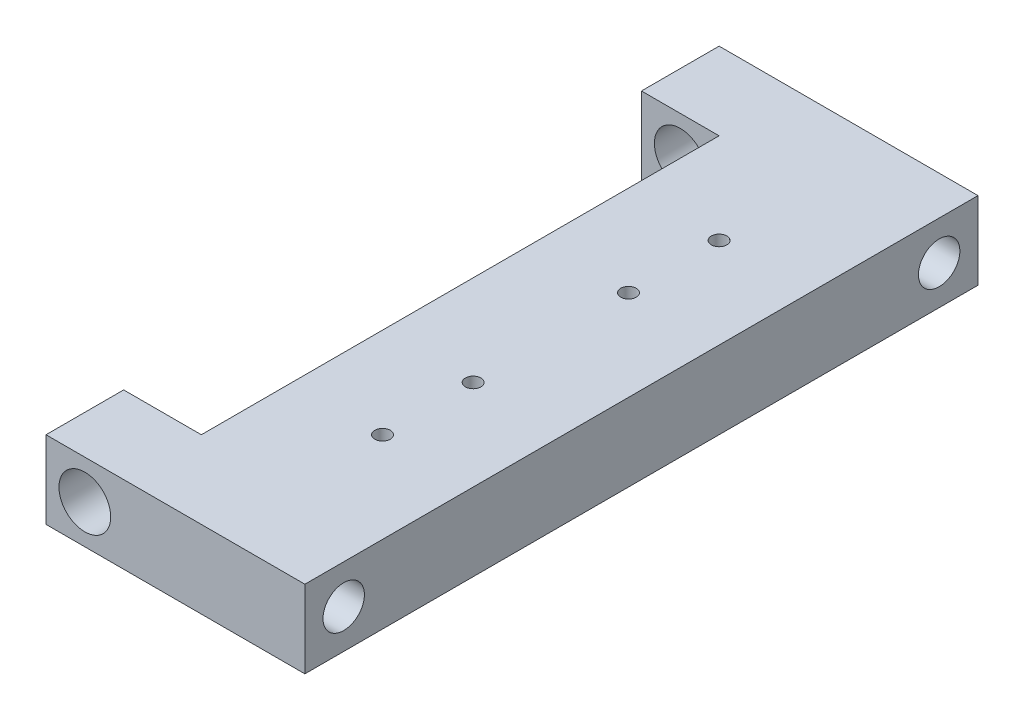
ISO-10303-21;
HEADER;
FILE_DESCRIPTION(('STEP AP214'),'2;1');
FILE_NAME('part.step','',(''),(''),'','','');
FILE_SCHEMA(('AUTOMOTIVE_DESIGN { 1 0 10303 214 1 1 1 1 }'));
ENDSEC;
DATA;
#1=APPLICATION_CONTEXT('core data for automotive mechanical design processes');
#2=APPLICATION_PROTOCOL_DEFINITION('international standard','automotive_design',2000,#1);
#3=PRODUCT_CONTEXT('',#1,'mechanical');
#4=PRODUCT('Part','Part','',(#3));
#5=PRODUCT_RELATED_PRODUCT_CATEGORY('part','',(#4));
#6=PRODUCT_DEFINITION_FORMATION('','',#4);
#7=PRODUCT_DEFINITION_CONTEXT('part definition',#1,'design');
#8=PRODUCT_DEFINITION('design','',#6,#7);
#9=PRODUCT_DEFINITION_SHAPE('','',#8);
#10=(LENGTH_UNIT() NAMED_UNIT(*) SI_UNIT(.MILLI.,.METRE.));
#11=(NAMED_UNIT(*) PLANE_ANGLE_UNIT() SI_UNIT($,.RADIAN.));
#12=(NAMED_UNIT(*) SI_UNIT($,.STERADIAN.) SOLID_ANGLE_UNIT());
#13=UNCERTAINTY_MEASURE_WITH_UNIT(LENGTH_MEASURE(1.E-05),#10,'distance_accuracy_value','');
#14=(GEOMETRIC_REPRESENTATION_CONTEXT(3) GLOBAL_UNCERTAINTY_ASSIGNED_CONTEXT((#13)) GLOBAL_UNIT_ASSIGNED_CONTEXT((#10,
#11,#12)) REPRESENTATION_CONTEXT('',''));
#15=CARTESIAN_POINT('',(0.,0.,0.));
#16=DIRECTION('',(0.,0.,1.));
#17=DIRECTION('',(1.,0.,0.));
#18=AXIS2_PLACEMENT_3D('',#15,#16,#17);
#19=CARTESIAN_POINT('',(0.,0.,130.));
#20=DIRECTION('',(0.,0.,-1.));
#21=DIRECTION('',(-1.,0.,0.));
#22=AXIS2_PLACEMENT_3D('',#19,#20,#21);
#23=CYLINDRICAL_SURFACE('',#22,5.);
#24=CARTESIAN_POINT('',(0.,0.,15.));
#25=DIRECTION('',(0.,0.,-1.));
#26=DIRECTION('',(-1.,0.,0.));
#27=AXIS2_PLACEMENT_3D('',#24,#25,#26);
#28=CIRCLE('',#27,5.);
#29=CARTESIAN_POINT('',(-5.,0.,15.));
#30=VERTEX_POINT('',#29);
#31=EDGE_CURVE('E177',#30,#30,#28,.T.);
#32=ORIENTED_EDGE('',*,*,#31,.F.);
#33=EDGE_LOOP('',(#32));
#34=FACE_BOUND('',#33,.T.);
#35=CARTESIAN_POINT('',(0.,0.,0.));
#36=DIRECTION('',(0.,0.,1.));
#37=DIRECTION('',(1.,0.,0.));
#38=AXIS2_PLACEMENT_3D('',#35,#36,#37);
#39=CIRCLE('',#38,5.);
#40=CARTESIAN_POINT('',(5.,0.,0.));
#41=VERTEX_POINT('',#40);
#42=EDGE_CURVE('E150',#41,#41,#39,.T.);
#43=ORIENTED_EDGE('',*,*,#42,.F.);
#44=EDGE_LOOP('',(#43));
#45=FACE_BOUND('',#44,.T.);
#46=ADVANCED_FACE('F35',(#34,#45),#23,.F.);
#47=CARTESIAN_POINT('',(-7.49999999999999,-40.7446847718792,130.));
#48=DIRECTION('',(1.,0.,0.));
#49=DIRECTION('',(0.,1.,0.));
#50=AXIS2_PLACEMENT_3D('',#47,#48,#49);
#51=PLANE('',#50);
#52=DIRECTION('',(0.,0.,-1.));
#53=VECTOR('',#52,1.);
#54=CARTESIAN_POINT('',(-7.5,-7.5,130.));
#55=LINE('',#54,#53);
#56=CARTESIAN_POINT('',(-7.5,-7.5,15.));
#57=VERTEX_POINT('',#56);
#58=CARTESIAN_POINT('',(-7.5,-7.5,0.));
#59=VERTEX_POINT('',#58);
#60=EDGE_CURVE('E82',#57,#59,#55,.T.);
#61=ORIENTED_EDGE('',*,*,#60,.F.);
#62=DIRECTION('',(0.,1.,0.));
#63=VECTOR('',#62,1.);
#64=CARTESIAN_POINT('',(-7.49999999999999,-40.7446847718792,15.));
#65=LINE('',#64,#63);
#66=CARTESIAN_POINT('',(-7.5,7.5,15.));
#67=VERTEX_POINT('',#66);
#68=EDGE_CURVE('E11',#57,#67,#65,.T.);
#69=ORIENTED_EDGE('',*,*,#68,.T.);
#70=DIRECTION('',(0.,0.,-1.));
#71=VECTOR('',#70,1.);
#72=CARTESIAN_POINT('',(-7.5,7.5,130.));
#73=LINE('',#72,#71);
#74=CARTESIAN_POINT('',(-7.5,7.5,0.));
#75=VERTEX_POINT('',#74);
#76=EDGE_CURVE('E129',#67,#75,#73,.T.);
#77=ORIENTED_EDGE('',*,*,#76,.T.);
#78=DIRECTION('',(0.,-1.,0.));
#79=VECTOR('',#78,1.);
#80=CARTESIAN_POINT('',(-7.49999999999999,-40.7446847718792,0.));
#81=LINE('',#80,#79);
#82=EDGE_CURVE('E156',#75,#59,#81,.T.);
#83=ORIENTED_EDGE('',*,*,#82,.T.);
#84=EDGE_LOOP('',(#61,#69,#77,#83));
#85=FACE_BOUND('',#84,.T.);
#86=ADVANCED_FACE('F264',(#85),#51,.F.);
#87=CARTESIAN_POINT('',(17.5,-7.5,130.));
#88=DIRECTION('',(0.,1.,0.));
#89=DIRECTION('',(0.,0.,1.));
#90=AXIS2_PLACEMENT_3D('',#87,#88,#89);
#91=PLANE('',#90);
#92=CARTESIAN_POINT('',(25.,-7.5,80.));
#93=DIRECTION('',(0.,1.,0.));
#94=DIRECTION('',(1.,0.,0.));
#95=AXIS2_PLACEMENT_3D('',#92,#93,#94);
#96=CIRCLE('',#95,1.5);
#97=CARTESIAN_POINT('',(26.5,-7.5,80.));
#98=VERTEX_POINT('',#97);
#99=EDGE_CURVE('E219',#98,#98,#96,.T.);
#100=ORIENTED_EDGE('',*,*,#99,.T.);
#101=EDGE_LOOP('',(#100));
#102=FACE_BOUND('',#101,.T.);
#103=CARTESIAN_POINT('',(25.,-7.5,50.));
#104=DIRECTION('',(0.,1.,0.));
#105=DIRECTION('',(-1.,0.,0.));
#106=AXIS2_PLACEMENT_3D('',#103,#104,#105);
#107=CIRCLE('',#106,1.5);
#108=CARTESIAN_POINT('',(23.5,-7.5,50.));
#109=VERTEX_POINT('',#108);
#110=EDGE_CURVE('E213',#109,#109,#107,.T.);
#111=ORIENTED_EDGE('',*,*,#110,.T.);
#112=EDGE_LOOP('',(#111));
#113=FACE_BOUND('',#112,.T.);
#114=DIRECTION('',(0.,0.,-1.));
#115=VECTOR('',#114,1.);
#116=CARTESIAN_POINT('',(7.50000000000002,-7.5,130.));
#117=LINE('',#116,#115);
#118=CARTESIAN_POINT('',(7.50000000000001,-7.5,115.));
#119=VERTEX_POINT('',#118);
#120=CARTESIAN_POINT('',(7.5,-7.5,15.));
#121=VERTEX_POINT('',#120);
#122=EDGE_CURVE('E167',#119,#121,#117,.T.);
#123=ORIENTED_EDGE('',*,*,#122,.T.);
#124=DIRECTION('',(-1.,0.,0.));
#125=VECTOR('',#124,1.);
#126=CARTESIAN_POINT('',(17.5,-7.5,15.));
#127=LINE('',#126,#125);
#128=EDGE_CURVE('E176',#121,#57,#127,.T.);
#129=ORIENTED_EDGE('',*,*,#128,.T.);
#130=ORIENTED_EDGE('',*,*,#60,.T.);
#131=DIRECTION('',(1.,0.,0.));
#132=VECTOR('',#131,1.);
#133=CARTESIAN_POINT('',(17.5,-7.5,0.));
#134=LINE('',#133,#132);
#135=CARTESIAN_POINT('',(42.5,-7.49999999999999,0.));
#136=VERTEX_POINT('',#135);
#137=EDGE_CURVE('E145',#59,#136,#134,.T.);
#138=ORIENTED_EDGE('',*,*,#137,.T.);
#139=DIRECTION('',(0.,0.,-1.));
#140=VECTOR('',#139,1.);
#141=CARTESIAN_POINT('',(42.5,-7.49999999999999,130.));
#142=LINE('',#141,#140);
#143=CARTESIAN_POINT('',(42.5,-7.49999999999999,130.));
#144=VERTEX_POINT('',#143);
#145=EDGE_CURVE('E117',#144,#136,#142,.T.);
#146=ORIENTED_EDGE('',*,*,#145,.F.);
#147=DIRECTION('',(1.,0.,0.));
#148=VECTOR('',#147,1.);
#149=CARTESIAN_POINT('',(17.5,-7.5,130.));
#150=LINE('',#149,#148);
#151=CARTESIAN_POINT('',(-7.5,-7.5,130.));
#152=VERTEX_POINT('',#151);
#153=EDGE_CURVE('E87',#152,#144,#150,.T.);
#154=ORIENTED_EDGE('',*,*,#153,.F.);
#155=CARTESIAN_POINT('',(-7.5,-7.5,115.));
#156=VERTEX_POINT('',#155);
#157=EDGE_CURVE('E132',#152,#156,#55,.T.);
#158=ORIENTED_EDGE('',*,*,#157,.T.);
#159=DIRECTION('',(1.,0.,0.));
#160=VECTOR('',#159,1.);
#161=CARTESIAN_POINT('',(17.5,-7.5,115.));
#162=LINE('',#161,#160);
#163=EDGE_CURVE('E50',#156,#119,#162,.T.);
#164=ORIENTED_EDGE('',*,*,#163,.T.);
#165=EDGE_LOOP('',(#123,#129,#130,#138,#146,#154,#158,#164));
#166=FACE_BOUND('',#165,.T.);
#167=ADVANCED_FACE('F147',(#102,#113,#166),#91,.F.);
#168=CARTESIAN_POINT('',(42.5,-40.7446847718792,130.));
#169=DIRECTION('',(1.,0.,0.));
#170=DIRECTION('',(0.,0.,-1.));
#171=AXIS2_PLACEMENT_3D('',#168,#169,#170);
#172=PLANE('',#171);
#173=CARTESIAN_POINT('',(42.5,0.,7.5));
#174=DIRECTION('',(1.,0.,0.));
#175=DIRECTION('',(0.,-1.,0.));
#176=AXIS2_PLACEMENT_3D('',#173,#174,#175);
#177=CIRCLE('',#176,4.00000000000001);
#178=CARTESIAN_POINT('',(42.5,-4.00000000000001,7.5));
#179=VERTEX_POINT('',#178);
#180=EDGE_CURVE('E198',#179,#179,#177,.T.);
#181=ORIENTED_EDGE('',*,*,#180,.F.);
#182=EDGE_LOOP('',(#181));
#183=FACE_BOUND('',#182,.T.);
#184=CARTESIAN_POINT('',(42.5,0.,122.5));
#185=DIRECTION('',(1.,0.,0.));
#186=DIRECTION('',(0.,1.,0.));
#187=AXIS2_PLACEMENT_3D('',#184,#185,#186);
#188=CIRCLE('',#187,4.00000000000001);
#189=CARTESIAN_POINT('',(42.5,4.00000000000001,122.5));
#190=VERTEX_POINT('',#189);
#191=EDGE_CURVE('E192',#190,#190,#188,.T.);
#192=ORIENTED_EDGE('',*,*,#191,.F.);
#193=EDGE_LOOP('',(#192));
#194=FACE_BOUND('',#193,.T.);
#195=DIRECTION('',(0.,-1.,0.));
#196=VECTOR('',#195,1.);
#197=CARTESIAN_POINT('',(42.5,-40.7446847718792,0.));
#198=LINE('',#197,#196);
#199=CARTESIAN_POINT('',(42.5,7.5,0.));
#200=VERTEX_POINT('',#199);
#201=EDGE_CURVE('E141',#200,#136,#198,.T.);
#202=ORIENTED_EDGE('',*,*,#201,.F.);
#203=DIRECTION('',(0.,0.,-1.));
#204=VECTOR('',#203,1.);
#205=CARTESIAN_POINT('',(42.5,7.5,130.));
#206=LINE('',#205,#204);
#207=CARTESIAN_POINT('',(42.5,7.5,130.));
#208=VERTEX_POINT('',#207);
#209=EDGE_CURVE('E128',#208,#200,#206,.T.);
#210=ORIENTED_EDGE('',*,*,#209,.F.);
#211=DIRECTION('',(0.,-1.,0.));
#212=VECTOR('',#211,1.);
#213=CARTESIAN_POINT('',(42.5,-40.7446847718792,130.));
#214=LINE('',#213,#212);
#215=EDGE_CURVE('E143',#208,#144,#214,.T.);
#216=ORIENTED_EDGE('',*,*,#215,.T.);
#217=ORIENTED_EDGE('',*,*,#145,.T.);
#218=EDGE_LOOP('',(#202,#210,#216,#217));
#219=FACE_BOUND('',#218,.T.);
#220=ADVANCED_FACE('F139',(#183,#194,#219),#172,.T.);
#221=CARTESIAN_POINT('',(17.5,7.5,130.));
#222=DIRECTION('',(0.,1.,0.));
#223=DIRECTION('',(-1.,0.,0.));
#224=AXIS2_PLACEMENT_3D('',#221,#222,#223);
#225=PLANE('',#224);
#226=CARTESIAN_POINT('',(25.,7.5,80.));
#227=DIRECTION('',(0.,1.,0.));
#228=DIRECTION('',(1.,0.,0.));
#229=AXIS2_PLACEMENT_3D('',#226,#227,#228);
#230=CIRCLE('',#229,1.5);
#231=CARTESIAN_POINT('',(26.5,7.5,80.));
#232=VERTEX_POINT('',#231);
#233=EDGE_CURVE('E222',#232,#232,#230,.T.);
#234=ORIENTED_EDGE('',*,*,#233,.F.);
#235=EDGE_LOOP('',(#234));
#236=FACE_BOUND('',#235,.T.);
#237=CARTESIAN_POINT('',(25.,7.5,50.));
#238=DIRECTION('',(0.,1.,0.));
#239=DIRECTION('',(-1.,0.,0.));
#240=AXIS2_PLACEMENT_3D('',#237,#238,#239);
#241=CIRCLE('',#240,1.5);
#242=CARTESIAN_POINT('',(23.5,7.5,50.));
#243=VERTEX_POINT('',#242);
#244=EDGE_CURVE('E216',#243,#243,#241,.T.);
#245=ORIENTED_EDGE('',*,*,#244,.F.);
#246=EDGE_LOOP('',(#245));
#247=FACE_BOUND('',#246,.T.);
#248=CARTESIAN_POINT('',(25.,7.5,97.5));
#249=DIRECTION('',(0.,1.,0.));
#250=DIRECTION('',(1.,0.,0.));
#251=AXIS2_PLACEMENT_3D('',#248,#249,#250);
#252=CIRCLE('',#251,1.5);
#253=CARTESIAN_POINT('',(26.5,7.5,97.5));
#254=VERTEX_POINT('',#253);
#255=EDGE_CURVE('E210',#254,#254,#252,.T.);
#256=ORIENTED_EDGE('',*,*,#255,.F.);
#257=EDGE_LOOP('',(#256));
#258=FACE_BOUND('',#257,.T.);
#259=CARTESIAN_POINT('',(25.,7.5,32.5));
#260=DIRECTION('',(0.,1.,0.));
#261=DIRECTION('',(-1.,0.,0.));
#262=AXIS2_PLACEMENT_3D('',#259,#260,#261);
#263=CIRCLE('',#262,1.5);
#264=CARTESIAN_POINT('',(23.5,7.5,32.5));
#265=VERTEX_POINT('',#264);
#266=EDGE_CURVE('E204',#265,#265,#263,.T.);
#267=ORIENTED_EDGE('',*,*,#266,.F.);
#268=EDGE_LOOP('',(#267));
#269=FACE_BOUND('',#268,.T.);
#270=DIRECTION('',(-1.,0.,0.));
#271=VECTOR('',#270,1.);
#272=CARTESIAN_POINT('',(-7.5,7.5,15.));
#273=LINE('',#272,#271);
#274=CARTESIAN_POINT('',(7.5,7.5,15.));
#275=VERTEX_POINT('',#274);
#276=EDGE_CURVE('E188',#275,#67,#273,.T.);
#277=ORIENTED_EDGE('',*,*,#276,.F.);
#278=DIRECTION('',(0.,0.,-1.));
#279=VECTOR('',#278,1.);
#280=CARTESIAN_POINT('',(7.5,7.5,15.));
#281=LINE('',#280,#279);
#282=CARTESIAN_POINT('',(7.50000000000001,7.5,115.));
#283=VERTEX_POINT('',#282);
#284=EDGE_CURVE('E124',#283,#275,#281,.T.);
#285=ORIENTED_EDGE('',*,*,#284,.F.);
#286=DIRECTION('',(1.,0.,0.));
#287=VECTOR('',#286,1.);
#288=CARTESIAN_POINT('',(-7.49999999999999,7.5,115.));
#289=LINE('',#288,#287);
#290=CARTESIAN_POINT('',(-7.49999999999999,7.5,115.));
#291=VERTEX_POINT('',#290);
#292=EDGE_CURVE('E112',#291,#283,#289,.T.);
#293=ORIENTED_EDGE('',*,*,#292,.F.);
#294=CARTESIAN_POINT('',(-7.5,7.5,130.));
#295=VERTEX_POINT('',#294);
#296=EDGE_CURVE('E122',#295,#291,#73,.T.);
#297=ORIENTED_EDGE('',*,*,#296,.F.);
#298=DIRECTION('',(1.,0.,0.));
#299=VECTOR('',#298,1.);
#300=CARTESIAN_POINT('',(17.5,7.5,130.));
#301=LINE('',#300,#299);
#302=EDGE_CURVE('E171',#295,#208,#301,.T.);
#303=ORIENTED_EDGE('',*,*,#302,.T.);
#304=ORIENTED_EDGE('',*,*,#209,.T.);
#305=DIRECTION('',(1.,0.,0.));
#306=VECTOR('',#305,1.);
#307=CARTESIAN_POINT('',(17.5,7.5,0.));
#308=LINE('',#307,#306);
#309=EDGE_CURVE('E154',#75,#200,#308,.T.);
#310=ORIENTED_EDGE('',*,*,#309,.F.);
#311=ORIENTED_EDGE('',*,*,#76,.F.);
#312=EDGE_LOOP('',(#277,#285,#293,#297,#303,#304,#310,#311));
#313=FACE_BOUND('',#312,.T.);
#314=ADVANCED_FACE('F120',(#236,#247,#258,#269,#313),#225,.T.);
#315=CARTESIAN_POINT('',(0.,0.,115.));
#316=DIRECTION('',(0.,0.,1.));
#317=DIRECTION('',(1.,0.,0.));
#318=AXIS2_PLACEMENT_3D('',#315,#316,#317);
#319=CIRCLE('',#318,5.);
#320=CARTESIAN_POINT('',(5.,0.,115.));
#321=VERTEX_POINT('',#320);
#322=EDGE_CURVE('E182',#321,#321,#319,.T.);
#323=ORIENTED_EDGE('',*,*,#322,.F.);
#324=EDGE_LOOP('',(#323));
#325=FACE_BOUND('',#324,.T.);
#326=CARTESIAN_POINT('',(0.,0.,130.));
#327=DIRECTION('',(0.,0.,1.));
#328=DIRECTION('',(1.,0.,0.));
#329=AXIS2_PLACEMENT_3D('',#326,#327,#328);
#330=CIRCLE('',#329,5.);
#331=CARTESIAN_POINT('',(5.,0.,130.));
#332=VERTEX_POINT('',#331);
#333=EDGE_CURVE('E159',#332,#332,#330,.T.);
#334=ORIENTED_EDGE('',*,*,#333,.T.);
#335=EDGE_LOOP('',(#334));
#336=FACE_BOUND('',#335,.T.);
#337=ADVANCED_FACE('F37',(#325,#336),#23,.F.);
#338=ORIENTED_EDGE('',*,*,#296,.T.);
#339=DIRECTION('',(0.,-1.,0.));
#340=VECTOR('',#339,1.);
#341=CARTESIAN_POINT('',(-7.49999999999999,-40.7446847718792,115.));
#342=LINE('',#341,#340);
#343=EDGE_CURVE('E43',#291,#156,#342,.T.);
#344=ORIENTED_EDGE('',*,*,#343,.T.);
#345=ORIENTED_EDGE('',*,*,#157,.F.);
#346=DIRECTION('',(0.,-1.,0.));
#347=VECTOR('',#346,1.);
#348=CARTESIAN_POINT('',(-7.49999999999999,-40.7446847718792,130.));
#349=LINE('',#348,#347);
#350=EDGE_CURVE('E59',#295,#152,#349,.T.);
#351=ORIENTED_EDGE('',*,*,#350,.F.);
#352=EDGE_LOOP('',(#338,#344,#345,#351));
#353=FACE_BOUND('',#352,.T.);
#354=ADVANCED_FACE('F127',(#353),#51,.F.);
#355=CARTESIAN_POINT('',(17.5,-40.7446847718792,130.));
#356=DIRECTION('',(0.,0.,1.));
#357=DIRECTION('',(1.,0.,0.));
#358=AXIS2_PLACEMENT_3D('',#355,#356,#357);
#359=PLANE('',#358);
#360=ORIENTED_EDGE('',*,*,#333,.F.);
#361=EDGE_LOOP('',(#360));
#362=FACE_BOUND('',#361,.T.);
#363=ORIENTED_EDGE('',*,*,#153,.T.);
#364=ORIENTED_EDGE('',*,*,#215,.F.);
#365=ORIENTED_EDGE('',*,*,#302,.F.);
#366=ORIENTED_EDGE('',*,*,#350,.T.);
#367=EDGE_LOOP('',(#363,#364,#365,#366));
#368=FACE_BOUND('',#367,.T.);
#369=ADVANCED_FACE('F278',(#362,#368),#359,.T.);
#370=CARTESIAN_POINT('',(17.5,-40.7446847718792,0.));
#371=DIRECTION('',(0.,0.,1.));
#372=DIRECTION('',(1.,0.,0.));
#373=AXIS2_PLACEMENT_3D('',#370,#371,#372);
#374=PLANE('',#373);
#375=ORIENTED_EDGE('',*,*,#42,.T.);
#376=EDGE_LOOP('',(#375));
#377=FACE_BOUND('',#376,.T.);
#378=ORIENTED_EDGE('',*,*,#137,.F.);
#379=ORIENTED_EDGE('',*,*,#82,.F.);
#380=ORIENTED_EDGE('',*,*,#309,.T.);
#381=ORIENTED_EDGE('',*,*,#201,.T.);
#382=EDGE_LOOP('',(#378,#379,#380,#381));
#383=FACE_BOUND('',#382,.T.);
#384=ADVANCED_FACE('F152',(#377,#383),#374,.F.);
#385=CARTESIAN_POINT('',(7.5,-52.5,15.));
#386=DIRECTION('',(1.,0.,0.));
#387=DIRECTION('',(0.,0.,-1.));
#388=AXIS2_PLACEMENT_3D('',#385,#386,#387);
#389=PLANE('',#388);
#390=DIRECTION('',(0.,1.,0.));
#391=VECTOR('',#390,1.);
#392=CARTESIAN_POINT('',(7.50000000000001,-52.5,115.));
#393=LINE('',#392,#391);
#394=EDGE_CURVE('E186',#119,#283,#393,.T.);
#395=ORIENTED_EDGE('',*,*,#394,.T.);
#396=ORIENTED_EDGE('',*,*,#284,.T.);
#397=DIRECTION('',(0.,1.,0.));
#398=VECTOR('',#397,1.);
#399=CARTESIAN_POINT('',(7.5,-52.5,15.));
#400=LINE('',#399,#398);
#401=EDGE_CURVE('E185',#121,#275,#400,.T.);
#402=ORIENTED_EDGE('',*,*,#401,.F.);
#403=ORIENTED_EDGE('',*,*,#122,.F.);
#404=EDGE_LOOP('',(#395,#396,#402,#403));
#405=FACE_BOUND('',#404,.T.);
#406=ADVANCED_FACE('F292',(#405),#389,.F.);
#407=CARTESIAN_POINT('',(-7.5,-52.5,15.));
#408=DIRECTION('',(0.,0.,-1.));
#409=DIRECTION('',(-1.,0.,0.));
#410=AXIS2_PLACEMENT_3D('',#407,#408,#409);
#411=PLANE('',#410);
#412=ORIENTED_EDGE('',*,*,#31,.T.);
#413=EDGE_LOOP('',(#412));
#414=FACE_BOUND('',#413,.T.);
#415=ORIENTED_EDGE('',*,*,#401,.T.);
#416=ORIENTED_EDGE('',*,*,#276,.T.);
#417=ORIENTED_EDGE('',*,*,#68,.F.);
#418=ORIENTED_EDGE('',*,*,#128,.F.);
#419=EDGE_LOOP('',(#415,#416,#417,#418));
#420=FACE_BOUND('',#419,.T.);
#421=ADVANCED_FACE('F283',(#414,#420),#411,.F.);
#422=CARTESIAN_POINT('',(-7.5,-52.5,115.));
#423=DIRECTION('',(0.,0.,1.));
#424=DIRECTION('',(1.,0.,0.));
#425=AXIS2_PLACEMENT_3D('',#422,#423,#424);
#426=PLANE('',#425);
#427=ORIENTED_EDGE('',*,*,#322,.T.);
#428=EDGE_LOOP('',(#427));
#429=FACE_BOUND('',#428,.T.);
#430=ORIENTED_EDGE('',*,*,#343,.F.);
#431=ORIENTED_EDGE('',*,*,#292,.T.);
#432=ORIENTED_EDGE('',*,*,#394,.F.);
#433=ORIENTED_EDGE('',*,*,#163,.F.);
#434=EDGE_LOOP('',(#430,#431,#432,#433));
#435=FACE_BOUND('',#434,.T.);
#436=ADVANCED_FACE('F111',(#429,#435),#426,.F.);
#437=CARTESIAN_POINT('',(7.5,0.,122.5));
#438=DIRECTION('',(1.,0.,0.));
#439=DIRECTION('',(0.,1.,0.));
#440=AXIS2_PLACEMENT_3D('',#437,#438,#439);
#441=CYLINDRICAL_SURFACE('',#440,4.00000000000001);
#442=CARTESIAN_POINT('',(7.5,0.,122.5));
#443=DIRECTION('',(1.,0.,0.));
#444=DIRECTION('',(0.,1.,0.));
#445=AXIS2_PLACEMENT_3D('',#442,#443,#444);
#446=CIRCLE('',#445,4.00000000000001);
#447=CARTESIAN_POINT('',(7.5,4.,122.5));
#448=VERTEX_POINT('',#447);
#449=EDGE_CURVE('E125',#448,#448,#446,.T.);
#450=ORIENTED_EDGE('',*,*,#449,.F.);
#451=EDGE_LOOP('',(#450));
#452=FACE_BOUND('',#451,.T.);
#453=ORIENTED_EDGE('',*,*,#191,.T.);
#454=EDGE_LOOP('',(#453));
#455=FACE_BOUND('',#454,.T.);
#456=ADVANCED_FACE('F282',(#452,#455),#441,.F.);
#457=CARTESIAN_POINT('',(7.5,0.,122.5));
#458=DIRECTION('',(1.,0.,0.));
#459=DIRECTION('',(0.,1.,0.));
#460=AXIS2_PLACEMENT_3D('',#457,#458,#459);
#461=PLANE('',#460);
#462=ORIENTED_EDGE('',*,*,#449,.T.);
#463=EDGE_LOOP('',(#462));
#464=FACE_BOUND('',#463,.T.);
#465=ADVANCED_FACE('F289',(#464),#461,.T.);
#466=CARTESIAN_POINT('',(7.5,0.,7.5));
#467=DIRECTION('',(1.,0.,0.));
#468=DIRECTION('',(0.,1.,0.));
#469=AXIS2_PLACEMENT_3D('',#466,#467,#468);
#470=CYLINDRICAL_SURFACE('',#469,4.00000000000001);
#471=CARTESIAN_POINT('',(7.5,0.,7.5));
#472=DIRECTION('',(1.,0.,0.));
#473=DIRECTION('',(0.,-1.,0.));
#474=AXIS2_PLACEMENT_3D('',#471,#472,#473);
#475=CIRCLE('',#474,4.00000000000001);
#476=CARTESIAN_POINT('',(7.5,-4.00000000000001,7.5));
#477=VERTEX_POINT('',#476);
#478=EDGE_CURVE('E195',#477,#477,#475,.T.);
#479=ORIENTED_EDGE('',*,*,#478,.F.);
#480=EDGE_LOOP('',(#479));
#481=FACE_BOUND('',#480,.T.);
#482=ORIENTED_EDGE('',*,*,#180,.T.);
#483=EDGE_LOOP('',(#482));
#484=FACE_BOUND('',#483,.T.);
#485=ADVANCED_FACE('F259',(#481,#484),#470,.F.);
#486=CARTESIAN_POINT('',(7.5,0.,7.5));
#487=DIRECTION('',(-1.,0.,0.));
#488=DIRECTION('',(0.,-1.,0.));
#489=AXIS2_PLACEMENT_3D('',#486,#487,#488);
#490=PLANE('',#489);
#491=ORIENTED_EDGE('',*,*,#478,.T.);
#492=EDGE_LOOP('',(#491));
#493=FACE_BOUND('',#492,.T.);
#494=ADVANCED_FACE('F249',(#493),#490,.F.);
#495=CARTESIAN_POINT('',(25.,2.5,32.5));
#496=DIRECTION('',(0.,1.,0.));
#497=DIRECTION('',(-1.,0.,0.));
#498=AXIS2_PLACEMENT_3D('',#495,#496,#497);
#499=CYLINDRICAL_SURFACE('',#498,1.5);
#500=CARTESIAN_POINT('',(25.,2.5,32.5));
#501=DIRECTION('',(0.,1.,0.));
#502=DIRECTION('',(-1.,0.,0.));
#503=AXIS2_PLACEMENT_3D('',#500,#501,#502);
#504=CIRCLE('',#503,1.5);
#505=CARTESIAN_POINT('',(23.5,2.5,32.5));
#506=VERTEX_POINT('',#505);
#507=EDGE_CURVE('E201',#506,#506,#504,.T.);
#508=ORIENTED_EDGE('',*,*,#507,.F.);
#509=EDGE_LOOP('',(#508));
#510=FACE_BOUND('',#509,.T.);
#511=ORIENTED_EDGE('',*,*,#266,.T.);
#512=EDGE_LOOP('',(#511));
#513=FACE_BOUND('',#512,.T.);
#514=ADVANCED_FACE('F246',(#510,#513),#499,.F.);
#515=CARTESIAN_POINT('',(25.,2.5,32.5));
#516=DIRECTION('',(0.,1.,0.));
#517=DIRECTION('',(-1.,0.,0.));
#518=AXIS2_PLACEMENT_3D('',#515,#516,#517);
#519=PLANE('',#518);
#520=ORIENTED_EDGE('',*,*,#507,.T.);
#521=EDGE_LOOP('',(#520));
#522=FACE_BOUND('',#521,.T.);
#523=ADVANCED_FACE('F248',(#522),#519,.T.);
#524=CARTESIAN_POINT('',(25.,2.5,97.5));
#525=DIRECTION('',(0.,1.,0.));
#526=DIRECTION('',(-1.,0.,0.));
#527=AXIS2_PLACEMENT_3D('',#524,#525,#526);
#528=CYLINDRICAL_SURFACE('',#527,1.5);
#529=CARTESIAN_POINT('',(25.,2.5,97.5));
#530=DIRECTION('',(0.,1.,0.));
#531=DIRECTION('',(1.,0.,0.));
#532=AXIS2_PLACEMENT_3D('',#529,#530,#531);
#533=CIRCLE('',#532,1.5);
#534=CARTESIAN_POINT('',(26.5,2.5,97.5));
#535=VERTEX_POINT('',#534);
#536=EDGE_CURVE('E207',#535,#535,#533,.T.);
#537=ORIENTED_EDGE('',*,*,#536,.F.);
#538=EDGE_LOOP('',(#537));
#539=FACE_BOUND('',#538,.T.);
#540=ORIENTED_EDGE('',*,*,#255,.T.);
#541=EDGE_LOOP('',(#540));
#542=FACE_BOUND('',#541,.T.);
#543=ADVANCED_FACE('F256',(#539,#542),#528,.F.);
#544=CARTESIAN_POINT('',(25.,2.5,97.5));
#545=DIRECTION('',(0.,-1.,0.));
#546=DIRECTION('',(1.,0.,0.));
#547=AXIS2_PLACEMENT_3D('',#544,#545,#546);
#548=PLANE('',#547);
#549=ORIENTED_EDGE('',*,*,#536,.T.);
#550=EDGE_LOOP('',(#549));
#551=FACE_BOUND('',#550,.T.);
#552=ADVANCED_FACE('F310',(#551),#548,.F.);
#553=CARTESIAN_POINT('',(25.,-7.5,50.));
#554=DIRECTION('',(0.,1.,0.));
#555=DIRECTION('',(-1.,0.,0.));
#556=AXIS2_PLACEMENT_3D('',#553,#554,#555);
#557=CYLINDRICAL_SURFACE('',#556,1.5);
#558=ORIENTED_EDGE('',*,*,#110,.F.);
#559=EDGE_LOOP('',(#558));
#560=FACE_BOUND('',#559,.T.);
#561=ORIENTED_EDGE('',*,*,#244,.T.);
#562=EDGE_LOOP('',(#561));
#563=FACE_BOUND('',#562,.T.);
#564=ADVANCED_FACE('F233',(#560,#563),#557,.F.);
#565=CARTESIAN_POINT('',(25.,-7.5,80.));
#566=DIRECTION('',(0.,1.,0.));
#567=DIRECTION('',(-1.,0.,0.));
#568=AXIS2_PLACEMENT_3D('',#565,#566,#567);
#569=CYLINDRICAL_SURFACE('',#568,1.5);
#570=ORIENTED_EDGE('',*,*,#99,.F.);
#571=EDGE_LOOP('',(#570));
#572=FACE_BOUND('',#571,.T.);
#573=ORIENTED_EDGE('',*,*,#233,.T.);
#574=EDGE_LOOP('',(#573));
#575=FACE_BOUND('',#574,.T.);
#576=ADVANCED_FACE('F230',(#572,#575),#569,.F.);
#577=CLOSED_SHELL('',(#46,#86,#167,#220,#314,#337,#354,#369,#384,#406,#421,#436,#456,#465,#485,
#494,#514,#523,#543,#552,#564,#576));
#578=MANIFOLD_SOLID_BREP('B2',#577);
#579=ADVANCED_BREP_SHAPE_REPRESENTATION('',(#18,#578),#14);
#580=SHAPE_DEFINITION_REPRESENTATION(#9,#579);
ENDSEC;
END-ISO-10303-21;
